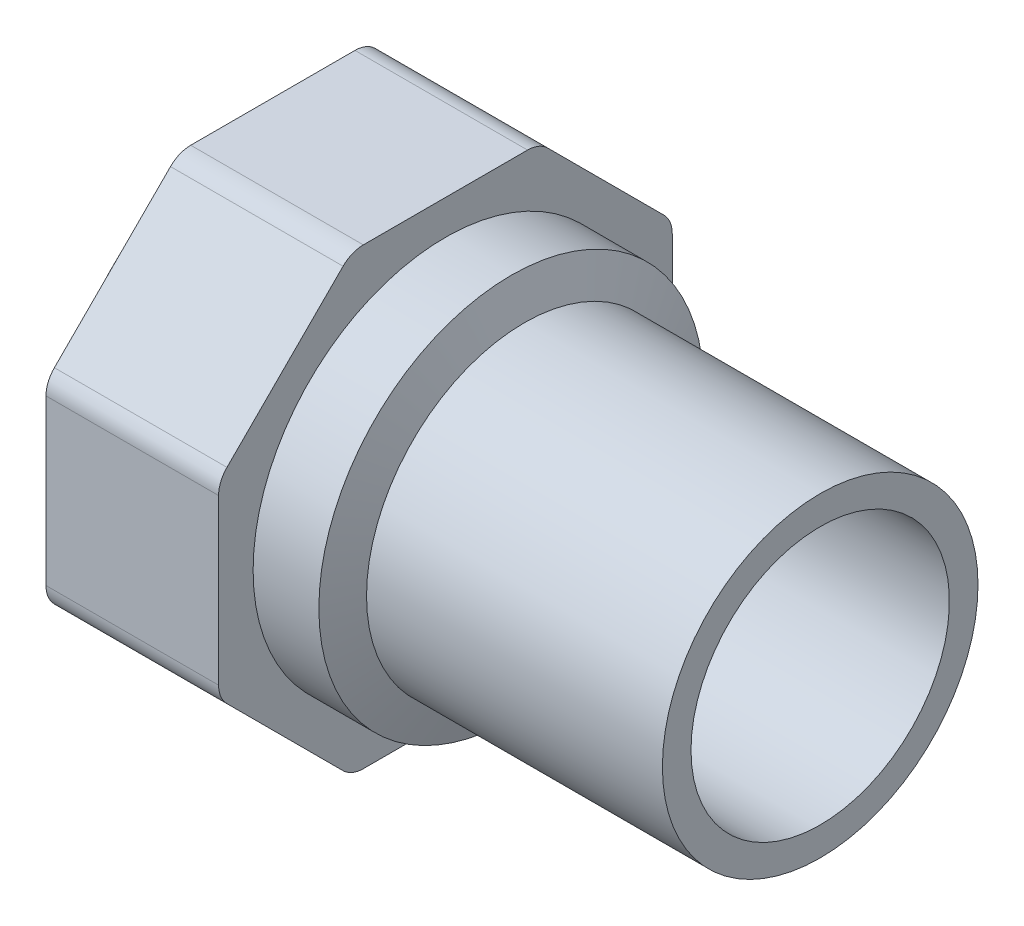
ISO-10303-21;
HEADER;
FILE_DESCRIPTION(('STEP AP214'),'2;1');
FILE_NAME('part.step','',(''),(''),'','','');
FILE_SCHEMA(('AUTOMOTIVE_DESIGN { 1 0 10303 214 1 1 1 1 }'));
ENDSEC;
DATA;
#1=APPLICATION_CONTEXT('core data for automotive mechanical design processes');
#2=APPLICATION_PROTOCOL_DEFINITION('international standard','automotive_design',2000,#1);
#3=PRODUCT_CONTEXT('',#1,'mechanical');
#4=PRODUCT('Part','Part','',(#3));
#5=PRODUCT_RELATED_PRODUCT_CATEGORY('part','',(#4));
#6=PRODUCT_DEFINITION_FORMATION('','',#4);
#7=PRODUCT_DEFINITION_CONTEXT('part definition',#1,'design');
#8=PRODUCT_DEFINITION('design','',#6,#7);
#9=PRODUCT_DEFINITION_SHAPE('','',#8);
#10=(LENGTH_UNIT() NAMED_UNIT(*) SI_UNIT(.MILLI.,.METRE.));
#11=(NAMED_UNIT(*) PLANE_ANGLE_UNIT() SI_UNIT($,.RADIAN.));
#12=(NAMED_UNIT(*) SI_UNIT($,.STERADIAN.) SOLID_ANGLE_UNIT());
#13=UNCERTAINTY_MEASURE_WITH_UNIT(LENGTH_MEASURE(1.E-05),#10,'distance_accuracy_value','');
#14=(GEOMETRIC_REPRESENTATION_CONTEXT(3) GLOBAL_UNCERTAINTY_ASSIGNED_CONTEXT((#13)) GLOBAL_UNIT_ASSIGNED_CONTEXT((#10,
#11,#12)) REPRESENTATION_CONTEXT('',''));
#15=CARTESIAN_POINT('',(0.,0.,0.));
#16=DIRECTION('',(0.,0.,1.));
#17=DIRECTION('',(1.,0.,0.));
#18=AXIS2_PLACEMENT_3D('',#15,#16,#17);
#19=CARTESIAN_POINT('',(-30.,0.,0.));
#20=DIRECTION('',(-1.,0.,0.));
#21=DIRECTION('',(0.,0.,1.));
#22=AXIS2_PLACEMENT_3D('',#19,#20,#21);
#23=CYLINDRICAL_SURFACE('',#22,16.);
#24=CARTESIAN_POINT('',(-30.,0.,0.));
#25=DIRECTION('',(1.,0.,0.));
#26=DIRECTION('',(0.,1.,0.));
#27=AXIS2_PLACEMENT_3D('',#24,#25,#26);
#28=CIRCLE('',#27,16.);
#29=CARTESIAN_POINT('',(-30.,16.,0.));
#30=VERTEX_POINT('',#29);
#31=EDGE_CURVE('E193',#30,#30,#28,.F.);
#32=ORIENTED_EDGE('',*,*,#31,.F.);
#33=EDGE_LOOP('',(#32));
#34=FACE_BOUND('',#33,.T.);
#35=CARTESIAN_POINT('',(0.,0.,0.));
#36=DIRECTION('',(-1.,0.,0.));
#37=DIRECTION('',(0.,0.,1.));
#38=AXIS2_PLACEMENT_3D('',#35,#36,#37);
#39=CIRCLE('',#38,16.);
#40=CARTESIAN_POINT('',(0.,0.,16.));
#41=VERTEX_POINT('',#40);
#42=EDGE_CURVE('E18',#41,#41,#39,.F.);
#43=ORIENTED_EDGE('',*,*,#42,.F.);
#44=EDGE_LOOP('',(#43));
#45=FACE_BOUND('',#44,.T.);
#46=ADVANCED_FACE('F15',(#34,#45),#23,.T.);
#47=CARTESIAN_POINT('',(-30.,0.,0.));
#48=DIRECTION('',(-1.,0.,0.));
#49=DIRECTION('',(0.,0.,1.));
#50=AXIS2_PLACEMENT_3D('',#47,#48,#49);
#51=CONICAL_SURFACE('',#50,16.,1.20681737028525);
#52=CARTESIAN_POINT('',(-31.3333333333333,0.,0.));
#53=DIRECTION('',(-1.,0.,0.));
#54=DIRECTION('',(0.,1.,0.));
#55=AXIS2_PLACEMENT_3D('',#52,#53,#54);
#56=CIRCLE('',#55,19.5);
#57=CARTESIAN_POINT('',(-31.3333333333333,19.5,0.));
#58=VERTEX_POINT('',#57);
#59=EDGE_CURVE('E189',#58,#58,#56,.T.);
#60=ORIENTED_EDGE('',*,*,#59,.F.);
#61=EDGE_LOOP('',(#60));
#62=FACE_BOUND('',#61,.T.);
#63=ORIENTED_EDGE('',*,*,#31,.T.);
#64=EDGE_LOOP('',(#63));
#65=FACE_BOUND('',#64,.T.);
#66=ADVANCED_FACE('F268',(#62,#65),#51,.T.);
#67=CARTESIAN_POINT('',(0.,16.,16.1920021082986));
#68=DIRECTION('',(1.,0.,0.));
#69=DIRECTION('',(0.,-1.,0.));
#70=AXIS2_PLACEMENT_3D('',#67,#68,#69);
#71=PLANE('',#70);
#72=CARTESIAN_POINT('',(0.,0.,0.));
#73=DIRECTION('',(-1.,0.,0.));
#74=DIRECTION('',(0.,0.,1.));
#75=AXIS2_PLACEMENT_3D('',#72,#73,#74);
#76=CIRCLE('',#75,13.1);
#77=CARTESIAN_POINT('',(0.,0.,13.1));
#78=VERTEX_POINT('',#77);
#79=EDGE_CURVE('E192',#78,#78,#76,.F.);
#80=ORIENTED_EDGE('',*,*,#79,.F.);
#81=EDGE_LOOP('',(#80));
#82=FACE_BOUND('',#81,.T.);
#83=ORIENTED_EDGE('',*,*,#42,.T.);
#84=EDGE_LOOP('',(#83));
#85=FACE_BOUND('',#84,.T.);
#86=ADVANCED_FACE('F264',(#82,#85),#71,.T.);
#87=CARTESIAN_POINT('',(-38.,0.,0.));
#88=DIRECTION('',(-1.,0.,0.));
#89=DIRECTION('',(0.,0.,1.));
#90=AXIS2_PLACEMENT_3D('',#87,#88,#89);
#91=CYLINDRICAL_SURFACE('',#90,19.5);
#92=CARTESIAN_POINT('',(-38.,0.,0.));
#93=DIRECTION('',(-1.,0.,0.));
#94=DIRECTION('',(0.,0.,1.));
#95=AXIS2_PLACEMENT_3D('',#92,#93,#94);
#96=CIRCLE('',#95,19.5);
#97=CARTESIAN_POINT('',(-38.,0.,19.5));
#98=VERTEX_POINT('',#97);
#99=EDGE_CURVE('E188',#98,#98,#96,.T.);
#100=ORIENTED_EDGE('',*,*,#99,.F.);
#101=EDGE_LOOP('',(#100));
#102=FACE_BOUND('',#101,.T.);
#103=ORIENTED_EDGE('',*,*,#59,.T.);
#104=EDGE_LOOP('',(#103));
#105=FACE_BOUND('',#104,.T.);
#106=ADVANCED_FACE('F267',(#102,#105),#91,.T.);
#107=CARTESIAN_POINT('',(0.,0.,0.));
#108=DIRECTION('',(-1.,0.,0.));
#109=DIRECTION('',(0.,0.,1.));
#110=AXIS2_PLACEMENT_3D('',#107,#108,#109);
#111=CYLINDRICAL_SURFACE('',#110,13.1);
#112=ORIENTED_EDGE('',*,*,#79,.T.);
#113=EDGE_LOOP('',(#112));
#114=FACE_BOUND('',#113,.T.);
#115=CARTESIAN_POINT('',(-37.4889077302988,0.,0.));
#116=DIRECTION('',(1.,0.,0.));
#117=DIRECTION('',(0.,1.,0.));
#118=AXIS2_PLACEMENT_3D('',#115,#116,#117);
#119=CIRCLE('',#118,13.1);
#120=CARTESIAN_POINT('',(-37.4889077302988,13.1,0.));
#121=VERTEX_POINT('',#120);
#122=EDGE_CURVE('E135',#121,#121,#119,.T.);
#123=ORIENTED_EDGE('',*,*,#122,.F.);
#124=EDGE_LOOP('',(#123));
#125=FACE_BOUND('',#124,.T.);
#126=ADVANCED_FACE('F261',(#114,#125),#111,.F.);
#127=CARTESIAN_POINT('',(-38.,23.,23.));
#128=DIRECTION('',(1.,0.,0.));
#129=DIRECTION('',(0.,-1.,0.));
#130=AXIS2_PLACEMENT_3D('',#127,#128,#129);
#131=PLANE('',#130);
#132=ORIENTED_EDGE('',*,*,#99,.T.);
#133=EDGE_LOOP('',(#132));
#134=FACE_BOUND('',#133,.T.);
#135=CARTESIAN_POINT('',(-38.,8.32569260369921,20.1));
#136=DIRECTION('',(1.,0.,0.));
#137=DIRECTION('',(0.,0.,-1.));
#138=AXIS2_PLACEMENT_3D('',#135,#136,#137);
#139=CIRCLE('',#138,2.89999999999997);
#140=CARTESIAN_POINT('',(-38.,8.32569260369921,23.));
#141=VERTEX_POINT('',#140);
#142=CARTESIAN_POINT('',(-38.,10.3763022691402,22.150609665441));
#143=VERTEX_POINT('',#142);
#144=EDGE_CURVE('E254',#141,#143,#139,.F.);
#145=ORIENTED_EDGE('',*,*,#144,.F.);
#146=DIRECTION('',(0.,1.,0.));
#147=VECTOR('',#146,1.);
#148=CARTESIAN_POINT('',(-38.,0.,23.));
#149=LINE('',#148,#147);
#150=CARTESIAN_POINT('',(-38.,-8.32569260369924,23.));
#151=VERTEX_POINT('',#150);
#152=EDGE_CURVE('E132',#151,#141,#149,.T.);
#153=ORIENTED_EDGE('',*,*,#152,.F.);
#154=CARTESIAN_POINT('',(-38.,-8.32569260369924,20.1));
#155=DIRECTION('',(1.,0.,0.));
#156=DIRECTION('',(0.,0.,-1.));
#157=AXIS2_PLACEMENT_3D('',#154,#155,#156);
#158=CIRCLE('',#157,2.89999999999999);
#159=CARTESIAN_POINT('',(-38.,-10.3763022691402,22.150609665441));
#160=VERTEX_POINT('',#159);
#161=EDGE_CURVE('E126',#160,#151,#158,.F.);
#162=ORIENTED_EDGE('',*,*,#161,.F.);
#163=DIRECTION('',(0.,0.707106781186547,0.707106781186548));
#164=VECTOR('',#163,1.);
#165=CARTESIAN_POINT('',(-38.,-16.2634559672906,16.2634559672906));
#166=LINE('',#165,#164);
#167=CARTESIAN_POINT('',(-38.,-22.150609665441,10.3763022691402));
#168=VERTEX_POINT('',#167);
#169=EDGE_CURVE('E130',#168,#160,#166,.T.);
#170=ORIENTED_EDGE('',*,*,#169,.F.);
#171=CARTESIAN_POINT('',(-38.,-20.1,8.32569260369922));
#172=DIRECTION('',(1.,0.,0.));
#173=DIRECTION('',(0.,0.,-1.));
#174=AXIS2_PLACEMENT_3D('',#171,#172,#173);
#175=CIRCLE('',#174,2.89999999999997);
#176=CARTESIAN_POINT('',(-38.,-23.,8.32569260369922));
#177=VERTEX_POINT('',#176);
#178=EDGE_CURVE('E149',#177,#168,#175,.F.);
#179=ORIENTED_EDGE('',*,*,#178,.F.);
#180=DIRECTION('',(0.,0.,1.));
#181=VECTOR('',#180,1.);
#182=CARTESIAN_POINT('',(-38.,-23.,0.));
#183=LINE('',#182,#181);
#184=CARTESIAN_POINT('',(-38.,-23.,-8.32569260369922));
#185=VERTEX_POINT('',#184);
#186=EDGE_CURVE('E154',#185,#177,#183,.T.);
#187=ORIENTED_EDGE('',*,*,#186,.F.);
#188=CARTESIAN_POINT('',(-38.,-20.1,-8.32569260369922));
#189=DIRECTION('',(1.,0.,0.));
#190=DIRECTION('',(0.,0.,-1.));
#191=AXIS2_PLACEMENT_3D('',#188,#189,#190);
#192=CIRCLE('',#191,2.89999999999999);
#193=CARTESIAN_POINT('',(-38.,-22.150609665441,-10.3763022691402));
#194=VERTEX_POINT('',#193);
#195=EDGE_CURVE('E239',#194,#185,#192,.F.);
#196=ORIENTED_EDGE('',*,*,#195,.F.);
#197=DIRECTION('',(0.,-0.707106781186548,0.707106781186547));
#198=VECTOR('',#197,1.);
#199=CARTESIAN_POINT('',(-38.,-16.2634559672906,-16.2634559672906));
#200=LINE('',#199,#198);
#201=CARTESIAN_POINT('',(-38.,-10.3763022691402,-22.150609665441));
#202=VERTEX_POINT('',#201);
#203=EDGE_CURVE('E159',#202,#194,#200,.T.);
#204=ORIENTED_EDGE('',*,*,#203,.F.);
#205=CARTESIAN_POINT('',(-38.,-8.32569260369921,-20.1));
#206=DIRECTION('',(1.,0.,0.));
#207=DIRECTION('',(0.,0.,-1.));
#208=AXIS2_PLACEMENT_3D('',#205,#206,#207);
#209=CIRCLE('',#208,2.89999999999998);
#210=CARTESIAN_POINT('',(-38.,-8.32569260369921,-23.));
#211=VERTEX_POINT('',#210);
#212=EDGE_CURVE('E242',#211,#202,#209,.F.);
#213=ORIENTED_EDGE('',*,*,#212,.F.);
#214=DIRECTION('',(0.,-1.,0.));
#215=VECTOR('',#214,1.);
#216=CARTESIAN_POINT('',(-38.,0.,-23.));
#217=LINE('',#216,#215);
#218=CARTESIAN_POINT('',(-38.,8.32569260369922,-23.));
#219=VERTEX_POINT('',#218);
#220=EDGE_CURVE('E164',#219,#211,#217,.T.);
#221=ORIENTED_EDGE('',*,*,#220,.F.);
#222=CARTESIAN_POINT('',(-38.,8.32569260369922,-20.1));
#223=DIRECTION('',(1.,0.,0.));
#224=DIRECTION('',(0.,0.,-1.));
#225=AXIS2_PLACEMENT_3D('',#222,#223,#224);
#226=CIRCLE('',#225,2.89999999999999);
#227=CARTESIAN_POINT('',(-38.,10.3763022691402,-22.150609665441));
#228=VERTEX_POINT('',#227);
#229=EDGE_CURVE('E245',#228,#219,#226,.F.);
#230=ORIENTED_EDGE('',*,*,#229,.F.);
#231=DIRECTION('',(0.,-0.707106781186547,-0.707106781186547));
#232=VECTOR('',#231,1.);
#233=CARTESIAN_POINT('',(-38.,16.2634559672906,-16.2634559672906));
#234=LINE('',#233,#232);
#235=CARTESIAN_POINT('',(-38.,22.150609665441,-10.3763022691402));
#236=VERTEX_POINT('',#235);
#237=EDGE_CURVE('E169',#236,#228,#234,.T.);
#238=ORIENTED_EDGE('',*,*,#237,.F.);
#239=CARTESIAN_POINT('',(-38.,20.1,-8.32569260369922));
#240=DIRECTION('',(1.,0.,0.));
#241=DIRECTION('',(0.,0.,-1.));
#242=AXIS2_PLACEMENT_3D('',#239,#240,#241);
#243=CIRCLE('',#242,2.89999999999998);
#244=CARTESIAN_POINT('',(-38.,23.,-8.32569260369922));
#245=VERTEX_POINT('',#244);
#246=EDGE_CURVE('E248',#245,#236,#243,.F.);
#247=ORIENTED_EDGE('',*,*,#246,.F.);
#248=DIRECTION('',(0.,0.,-1.));
#249=VECTOR('',#248,1.);
#250=CARTESIAN_POINT('',(-38.,23.,0.));
#251=LINE('',#250,#249);
#252=CARTESIAN_POINT('',(-38.,23.,8.32569260369922));
#253=VERTEX_POINT('',#252);
#254=EDGE_CURVE('E174',#253,#245,#251,.T.);
#255=ORIENTED_EDGE('',*,*,#254,.F.);
#256=CARTESIAN_POINT('',(-38.,20.1000000000001,8.32569260369922));
#257=DIRECTION('',(1.,0.,0.));
#258=DIRECTION('',(0.,0.,-1.));
#259=AXIS2_PLACEMENT_3D('',#256,#257,#258);
#260=CIRCLE('',#259,2.89999999999995);
#261=CARTESIAN_POINT('',(-38.,22.150609665441,10.3763022691402));
#262=VERTEX_POINT('',#261);
#263=EDGE_CURVE('E251',#262,#253,#260,.F.);
#264=ORIENTED_EDGE('',*,*,#263,.F.);
#265=DIRECTION('',(0.,0.707106781186548,-0.707106781186547));
#266=VECTOR('',#265,1.);
#267=CARTESIAN_POINT('',(-38.,16.2634559672906,16.2634559672906));
#268=LINE('',#267,#266);
#269=EDGE_CURVE('E179',#143,#262,#268,.T.);
#270=ORIENTED_EDGE('',*,*,#269,.F.);
#271=EDGE_LOOP('',(#145,#153,#162,#170,#179,#187,#196,#204,#213,#221,#230,#238,#247,#255,#264,#270));
#272=FACE_BOUND('',#271,.T.);
#273=ADVANCED_FACE('F128',(#134,#272),#131,.T.);
#274=CARTESIAN_POINT('',(-38.,0.,0.));
#275=DIRECTION('',(-1.,0.,0.));
#276=DIRECTION('',(0.,0.,1.));
#277=AXIS2_PLACEMENT_3D('',#274,#275,#276);
#278=CONICAL_SURFACE('',#277,13.9852377784781,1.0471975511966);
#279=ORIENTED_EDGE('',*,*,#122,.T.);
#280=EDGE_LOOP('',(#279));
#281=FACE_BOUND('',#280,.T.);
#282=CARTESIAN_POINT('',(-38.,0.,0.));
#283=DIRECTION('',(1.,0.,0.));
#284=DIRECTION('',(0.,1.,0.));
#285=AXIS2_PLACEMENT_3D('',#282,#283,#284);
#286=CIRCLE('',#285,13.9852377784781);
#287=CARTESIAN_POINT('',(-38.,13.9852377784781,0.));
#288=VERTEX_POINT('',#287);
#289=EDGE_CURVE('E153',#288,#288,#286,.T.);
#290=ORIENTED_EDGE('',*,*,#289,.F.);
#291=EDGE_LOOP('',(#290));
#292=FACE_BOUND('',#291,.T.);
#293=ADVANCED_FACE('F438',(#281,#292),#278,.F.);
#294=CARTESIAN_POINT('',(-38.,-8.32569260369924,20.1));
#295=DIRECTION('',(1.,0.,0.));
#296=DIRECTION('',(0.,0.,-1.));
#297=AXIS2_PLACEMENT_3D('',#294,#295,#296);
#298=CYLINDRICAL_SURFACE('',#297,2.89999999999999);
#299=CARTESIAN_POINT('',(-55.5,-8.32569260369924,20.1));
#300=DIRECTION('',(1.,0.,0.));
#301=DIRECTION('',(0.,0.,-1.));
#302=AXIS2_PLACEMENT_3D('',#299,#300,#301);
#303=CIRCLE('',#302,2.89999999999999);
#304=CARTESIAN_POINT('',(-55.5,-10.3763022691402,22.150609665441));
#305=VERTEX_POINT('',#304);
#306=CARTESIAN_POINT('',(-55.5,-8.32569260369924,23.));
#307=VERTEX_POINT('',#306);
#308=EDGE_CURVE('E141',#305,#307,#303,.F.);
#309=ORIENTED_EDGE('',*,*,#308,.F.);
#310=DIRECTION('',(1.,0.,0.));
#311=VECTOR('',#310,1.);
#312=CARTESIAN_POINT('',(-55.5,-10.3763022691402,22.150609665441));
#313=LINE('',#312,#311);
#314=EDGE_CURVE('E138',#160,#305,#313,.F.);
#315=ORIENTED_EDGE('',*,*,#314,.F.);
#316=ORIENTED_EDGE('',*,*,#161,.T.);
#317=DIRECTION('',(1.,0.,0.));
#318=VECTOR('',#317,1.);
#319=CARTESIAN_POINT('',(-55.5,-8.32569260369924,23.));
#320=LINE('',#319,#318);
#321=EDGE_CURVE('E185',#307,#151,#320,.T.);
#322=ORIENTED_EDGE('',*,*,#321,.F.);
#323=EDGE_LOOP('',(#309,#315,#316,#322));
#324=FACE_BOUND('',#323,.T.);
#325=ADVANCED_FACE('F139',(#324),#298,.T.);
#326=CARTESIAN_POINT('',(-55.5,8.3256926036992,23.));
#327=DIRECTION('',(0.,0.,1.));
#328=DIRECTION('',(0.,-1.,0.));
#329=AXIS2_PLACEMENT_3D('',#326,#327,#328);
#330=PLANE('',#329);
#331=DIRECTION('',(0.,1.,0.));
#332=VECTOR('',#331,1.);
#333=CARTESIAN_POINT('',(-55.5,0.,23.));
#334=LINE('',#333,#332);
#335=CARTESIAN_POINT('',(-55.5,8.32569260369921,23.));
#336=VERTEX_POINT('',#335);
#337=EDGE_CURVE('E236',#307,#336,#334,.T.);
#338=ORIENTED_EDGE('',*,*,#337,.F.);
#339=ORIENTED_EDGE('',*,*,#321,.T.);
#340=ORIENTED_EDGE('',*,*,#152,.T.);
#341=DIRECTION('',(1.,0.,0.));
#342=VECTOR('',#341,1.);
#343=CARTESIAN_POINT('',(-46.75,8.3256926036992,23.));
#344=LINE('',#343,#342);
#345=EDGE_CURVE('E183',#336,#141,#344,.T.);
#346=ORIENTED_EDGE('',*,*,#345,.F.);
#347=EDGE_LOOP('',(#338,#339,#340,#346));
#348=FACE_BOUND('',#347,.T.);
#349=ADVANCED_FACE('F387',(#348),#330,.T.);
#350=CARTESIAN_POINT('',(-38.,8.32569260369921,20.1));
#351=DIRECTION('',(1.,0.,0.));
#352=DIRECTION('',(0.,0.,-1.));
#353=AXIS2_PLACEMENT_3D('',#350,#351,#352);
#354=CYLINDRICAL_SURFACE('',#353,2.89999999999997);
#355=CARTESIAN_POINT('',(-55.5,8.32569260369921,20.1));
#356=DIRECTION('',(1.,0.,0.));
#357=DIRECTION('',(0.,0.,-1.));
#358=AXIS2_PLACEMENT_3D('',#355,#356,#357);
#359=CIRCLE('',#358,2.89999999999997);
#360=CARTESIAN_POINT('',(-55.5,10.3763022691402,22.150609665441));
#361=VERTEX_POINT('',#360);
#362=EDGE_CURVE('E233',#336,#361,#359,.F.);
#363=ORIENTED_EDGE('',*,*,#362,.F.);
#364=ORIENTED_EDGE('',*,*,#345,.T.);
#365=ORIENTED_EDGE('',*,*,#144,.T.);
#366=DIRECTION('',(1.,0.,0.));
#367=VECTOR('',#366,1.);
#368=CARTESIAN_POINT('',(-55.5,10.3763022691402,22.150609665441));
#369=LINE('',#368,#367);
#370=EDGE_CURVE('E182',#361,#143,#369,.T.);
#371=ORIENTED_EDGE('',*,*,#370,.F.);
#372=EDGE_LOOP('',(#363,#364,#365,#371));
#373=FACE_BOUND('',#372,.T.);
#374=ADVANCED_FACE('F425',(#373),#354,.T.);
#375=CARTESIAN_POINT('',(-55.5,22.150609665441,10.3763022691402));
#376=DIRECTION('',(0.,0.707106781186547,0.707106781186548));
#377=DIRECTION('',(0.,-0.707106781186548,0.707106781186547));
#378=AXIS2_PLACEMENT_3D('',#375,#376,#377);
#379=PLANE('',#378);
#380=CARTESIAN_POINT('',(-55.5,10.3763022691402,22.150609665441));
#381=CARTESIAN_POINT('',(-55.5,10.8668984106527,21.6600135239285));
#382=CARTESIAN_POINT('',(-55.5,11.3574945521653,21.1694173824159));
#383=CARTESIAN_POINT('',(-55.5,12.3386868351903,20.1882250993909));
#384=CARTESIAN_POINT('',(-55.5,12.8292829767029,19.6976289578783));
#385=CARTESIAN_POINT('',(-55.5,13.8104752597279,18.7164366748533));
#386=CARTESIAN_POINT('',(-55.5,14.3010714012405,18.2258405333407));
#387=CARTESIAN_POINT('',(-55.5,15.2822636842655,17.2446482503157));
#388=CARTESIAN_POINT('',(-55.5,15.7728598257781,16.7540521088031));
#389=CARTESIAN_POINT('',(-55.5,16.7540521088031,15.7728598257781));
#390=CARTESIAN_POINT('',(-55.5,17.2446482503156,15.2822636842655));
#391=CARTESIAN_POINT('',(-55.5,18.2258405333407,14.3010714012405));
#392=CARTESIAN_POINT('',(-55.5,18.7164366748532,13.8104752597279));
#393=CARTESIAN_POINT('',(-55.5,19.6976289578783,12.8292829767029));
#394=CARTESIAN_POINT('',(-55.5,20.1882250993908,12.3386868351903));
#395=CARTESIAN_POINT('',(-55.5,21.1694173824159,11.3574945521653));
#396=CARTESIAN_POINT('',(-55.5,21.6600135239284,10.8668984106527));
#397=CARTESIAN_POINT('',(-55.5,22.150609665441,10.3763022691402));
#398=B_SPLINE_CURVE_WITH_KNOTS('',3,(#380,#381,#382,#383,#384,#385,#386,#387,#388,#389,#390,
#391,#392,#393,#394,#395,#396,#397),.UNSPECIFIED.,.F.,.F.,(4,2,2,2,2,2,2,2,4),(0.,
2.08142315092481,4.16284630184961,6.24426945277441,8.32569260369921,10.407115754624,
12.4885389055488,14.5699620564736,16.6513852073984),.UNSPECIFIED.);
#399=CARTESIAN_POINT('',(-55.5,22.150609665441,10.3763022691402));
#400=VERTEX_POINT('',#399);
#401=EDGE_CURVE('E232',#361,#400,#398,.T.);
#402=ORIENTED_EDGE('',*,*,#401,.F.);
#403=ORIENTED_EDGE('',*,*,#370,.T.);
#404=ORIENTED_EDGE('',*,*,#269,.T.);
#405=DIRECTION('',(1.,0.,0.));
#406=VECTOR('',#405,1.);
#407=CARTESIAN_POINT('',(-46.75,22.150609665441,10.3763022691402));
#408=LINE('',#407,#406);
#409=EDGE_CURVE('E178',#400,#262,#408,.T.);
#410=ORIENTED_EDGE('',*,*,#409,.F.);
#411=EDGE_LOOP('',(#402,#403,#404,#410));
#412=FACE_BOUND('',#411,.T.);
#413=ADVANCED_FACE('F423',(#412),#379,.T.);
#414=CARTESIAN_POINT('',(-38.,20.1000000000001,8.32569260369922));
#415=DIRECTION('',(1.,0.,0.));
#416=DIRECTION('',(0.,0.,-1.));
#417=AXIS2_PLACEMENT_3D('',#414,#415,#416);
#418=CYLINDRICAL_SURFACE('',#417,2.89999999999995);
#419=CARTESIAN_POINT('',(-55.5,20.1000000000001,8.32569260369922));
#420=DIRECTION('',(1.,0.,0.));
#421=DIRECTION('',(0.,0.,-1.));
#422=AXIS2_PLACEMENT_3D('',#419,#420,#421);
#423=CIRCLE('',#422,2.89999999999995);
#424=CARTESIAN_POINT('',(-55.5,23.,8.32569260369922));
#425=VERTEX_POINT('',#424);
#426=EDGE_CURVE('E229',#400,#425,#423,.F.);
#427=ORIENTED_EDGE('',*,*,#426,.F.);
#428=ORIENTED_EDGE('',*,*,#409,.T.);
#429=ORIENTED_EDGE('',*,*,#263,.T.);
#430=DIRECTION('',(1.,0.,0.));
#431=VECTOR('',#430,1.);
#432=CARTESIAN_POINT('',(-55.5,23.,8.32569260369921));
#433=LINE('',#432,#431);
#434=EDGE_CURVE('E177',#425,#253,#433,.T.);
#435=ORIENTED_EDGE('',*,*,#434,.F.);
#436=EDGE_LOOP('',(#427,#428,#429,#435));
#437=FACE_BOUND('',#436,.T.);
#438=ADVANCED_FACE('F420',(#437),#418,.T.);
#439=CARTESIAN_POINT('',(-55.5,23.,-8.32569260369921));
#440=DIRECTION('',(0.,1.,0.));
#441=DIRECTION('',(0.,0.,1.));
#442=AXIS2_PLACEMENT_3D('',#439,#440,#441);
#443=PLANE('',#442);
#444=DIRECTION('',(0.,0.,-1.));
#445=VECTOR('',#444,1.);
#446=CARTESIAN_POINT('',(-55.5,23.,23.));
#447=LINE('',#446,#445);
#448=CARTESIAN_POINT('',(-55.5,23.,-8.32569260369922));
#449=VERTEX_POINT('',#448);
#450=EDGE_CURVE('E228',#425,#449,#447,.T.);
#451=ORIENTED_EDGE('',*,*,#450,.F.);
#452=ORIENTED_EDGE('',*,*,#434,.T.);
#453=ORIENTED_EDGE('',*,*,#254,.T.);
#454=DIRECTION('',(1.,0.,0.));
#455=VECTOR('',#454,1.);
#456=CARTESIAN_POINT('',(-46.75,23.,-8.32569260369922));
#457=LINE('',#456,#455);
#458=EDGE_CURVE('E173',#449,#245,#457,.T.);
#459=ORIENTED_EDGE('',*,*,#458,.F.);
#460=EDGE_LOOP('',(#451,#452,#453,#459));
#461=FACE_BOUND('',#460,.T.);
#462=ADVANCED_FACE('F417',(#461),#443,.T.);
#463=CARTESIAN_POINT('',(-38.,20.1,-8.32569260369922));
#464=DIRECTION('',(1.,0.,0.));
#465=DIRECTION('',(0.,0.,-1.));
#466=AXIS2_PLACEMENT_3D('',#463,#464,#465);
#467=CYLINDRICAL_SURFACE('',#466,2.89999999999998);
#468=CARTESIAN_POINT('',(-55.5,20.1,-8.32569260369922));
#469=DIRECTION('',(1.,0.,0.));
#470=DIRECTION('',(0.,0.,-1.));
#471=AXIS2_PLACEMENT_3D('',#468,#469,#470);
#472=CIRCLE('',#471,2.89999999999998);
#473=CARTESIAN_POINT('',(-55.5,22.150609665441,-10.3763022691402));
#474=VERTEX_POINT('',#473);
#475=EDGE_CURVE('E225',#449,#474,#472,.F.);
#476=ORIENTED_EDGE('',*,*,#475,.F.);
#477=ORIENTED_EDGE('',*,*,#458,.T.);
#478=ORIENTED_EDGE('',*,*,#246,.T.);
#479=DIRECTION('',(1.,0.,0.));
#480=VECTOR('',#479,1.);
#481=CARTESIAN_POINT('',(-55.5,22.150609665441,-10.3763022691402));
#482=LINE('',#481,#480);
#483=EDGE_CURVE('E172',#474,#236,#482,.T.);
#484=ORIENTED_EDGE('',*,*,#483,.F.);
#485=EDGE_LOOP('',(#476,#477,#478,#484));
#486=FACE_BOUND('',#485,.T.);
#487=ADVANCED_FACE('F414',(#486),#467,.T.);
#488=CARTESIAN_POINT('',(-55.5,10.3763022691402,-22.150609665441));
#489=DIRECTION('',(0.,0.707106781186547,-0.707106781186547));
#490=DIRECTION('',(0.,0.707106781186547,0.707106781186547));
#491=AXIS2_PLACEMENT_3D('',#488,#489,#490);
#492=PLANE('',#491);
#493=CARTESIAN_POINT('',(-55.5,22.150609665441,-10.3763022691402));
#494=CARTESIAN_POINT('',(-55.5,21.6600135239285,-10.8668984106527));
#495=CARTESIAN_POINT('',(-55.5,21.1694173824159,-11.3574945521653));
#496=CARTESIAN_POINT('',(-55.5,20.1882250993909,-12.3386868351903));
#497=CARTESIAN_POINT('',(-55.5,19.6976289578783,-12.8292829767029));
#498=CARTESIAN_POINT('',(-55.5,18.7164366748533,-13.8104752597279));
#499=CARTESIAN_POINT('',(-55.5,18.2258405333407,-14.3010714012405));
#500=CARTESIAN_POINT('',(-55.5,17.2446482503157,-15.2822636842655));
#501=CARTESIAN_POINT('',(-55.5,16.7540521088031,-15.7728598257781));
#502=CARTESIAN_POINT('',(-55.5,15.7728598257781,-16.7540521088031));
#503=CARTESIAN_POINT('',(-55.5,15.2822636842655,-17.2446482503157));
#504=CARTESIAN_POINT('',(-55.5,14.3010714012405,-18.2258405333407));
#505=CARTESIAN_POINT('',(-55.5,13.8104752597279,-18.7164366748533));
#506=CARTESIAN_POINT('',(-55.5,12.8292829767029,-19.6976289578783));
#507=CARTESIAN_POINT('',(-55.5,12.3386868351903,-20.1882250993909));
#508=CARTESIAN_POINT('',(-55.5,11.3574945521653,-21.1694173824159));
#509=CARTESIAN_POINT('',(-55.5,10.8668984106527,-21.6600135239284));
#510=CARTESIAN_POINT('',(-55.5,10.3763022691402,-22.150609665441));
#511=B_SPLINE_CURVE_WITH_KNOTS('',3,(#493,#494,#495,#496,#497,#498,#499,#500,#501,#502,#503,
#504,#505,#506,#507,#508,#509,#510),.UNSPECIFIED.,.F.,.F.,(4,2,2,2,2,2,2,2,4),(0.,
2.0814231509248,4.1628463018496,6.2442694527744,8.3256926036992,10.407115754624,
12.4885389055488,14.5699620564736,16.6513852073984),.UNSPECIFIED.);
#512=CARTESIAN_POINT('',(-55.5,10.3763022691402,-22.150609665441));
#513=VERTEX_POINT('',#512);
#514=EDGE_CURVE('E224',#474,#513,#511,.T.);
#515=ORIENTED_EDGE('',*,*,#514,.F.);
#516=ORIENTED_EDGE('',*,*,#483,.T.);
#517=ORIENTED_EDGE('',*,*,#237,.T.);
#518=DIRECTION('',(1.,0.,0.));
#519=VECTOR('',#518,1.);
#520=CARTESIAN_POINT('',(-46.75,10.3763022691402,-22.150609665441));
#521=LINE('',#520,#519);
#522=EDGE_CURVE('E168',#513,#228,#521,.T.);
#523=ORIENTED_EDGE('',*,*,#522,.F.);
#524=EDGE_LOOP('',(#515,#516,#517,#523));
#525=FACE_BOUND('',#524,.T.);
#526=ADVANCED_FACE('F411',(#525),#492,.T.);
#527=CARTESIAN_POINT('',(-38.,8.32569260369922,-20.1));
#528=DIRECTION('',(1.,0.,0.));
#529=DIRECTION('',(0.,0.,-1.));
#530=AXIS2_PLACEMENT_3D('',#527,#528,#529);
#531=CYLINDRICAL_SURFACE('',#530,2.89999999999999);
#532=CARTESIAN_POINT('',(-55.5,8.32569260369922,-20.1));
#533=DIRECTION('',(1.,0.,0.));
#534=DIRECTION('',(0.,0.,-1.));
#535=AXIS2_PLACEMENT_3D('',#532,#533,#534);
#536=CIRCLE('',#535,2.89999999999999);
#537=CARTESIAN_POINT('',(-55.5,8.32569260369922,-23.));
#538=VERTEX_POINT('',#537);
#539=EDGE_CURVE('E221',#513,#538,#536,.F.);
#540=ORIENTED_EDGE('',*,*,#539,.F.);
#541=ORIENTED_EDGE('',*,*,#522,.T.);
#542=ORIENTED_EDGE('',*,*,#229,.T.);
#543=DIRECTION('',(1.,0.,0.));
#544=VECTOR('',#543,1.);
#545=CARTESIAN_POINT('',(-55.5,8.32569260369922,-23.));
#546=LINE('',#545,#544);
#547=EDGE_CURVE('E167',#538,#219,#546,.T.);
#548=ORIENTED_EDGE('',*,*,#547,.F.);
#549=EDGE_LOOP('',(#540,#541,#542,#548));
#550=FACE_BOUND('',#549,.T.);
#551=ADVANCED_FACE('F408',(#550),#531,.T.);
#552=CARTESIAN_POINT('',(-55.5,-8.3256926036992,-23.));
#553=DIRECTION('',(0.,0.,-1.));
#554=DIRECTION('',(0.,1.,0.));
#555=AXIS2_PLACEMENT_3D('',#552,#553,#554);
#556=PLANE('',#555);
#557=DIRECTION('',(0.,-1.,0.));
#558=VECTOR('',#557,1.);
#559=CARTESIAN_POINT('',(-55.5,0.,-23.));
#560=LINE('',#559,#558);
#561=CARTESIAN_POINT('',(-55.5,-8.32569260369921,-23.));
#562=VERTEX_POINT('',#561);
#563=EDGE_CURVE('E220',#538,#562,#560,.T.);
#564=ORIENTED_EDGE('',*,*,#563,.F.);
#565=ORIENTED_EDGE('',*,*,#547,.T.);
#566=ORIENTED_EDGE('',*,*,#220,.T.);
#567=DIRECTION('',(1.,0.,0.));
#568=VECTOR('',#567,1.);
#569=CARTESIAN_POINT('',(-46.75,-8.3256926036992,-23.));
#570=LINE('',#569,#568);
#571=EDGE_CURVE('E163',#562,#211,#570,.T.);
#572=ORIENTED_EDGE('',*,*,#571,.F.);
#573=EDGE_LOOP('',(#564,#565,#566,#572));
#574=FACE_BOUND('',#573,.T.);
#575=ADVANCED_FACE('F405',(#574),#556,.T.);
#576=CARTESIAN_POINT('',(-38.,-8.32569260369921,-20.1));
#577=DIRECTION('',(1.,0.,0.));
#578=DIRECTION('',(0.,0.,-1.));
#579=AXIS2_PLACEMENT_3D('',#576,#577,#578);
#580=CYLINDRICAL_SURFACE('',#579,2.89999999999998);
#581=CARTESIAN_POINT('',(-55.5,-8.32569260369921,-20.1));
#582=DIRECTION('',(1.,0.,0.));
#583=DIRECTION('',(0.,0.,-1.));
#584=AXIS2_PLACEMENT_3D('',#581,#582,#583);
#585=CIRCLE('',#584,2.89999999999998);
#586=CARTESIAN_POINT('',(-55.5,-10.3763022691402,-22.150609665441));
#587=VERTEX_POINT('',#586);
#588=EDGE_CURVE('E217',#562,#587,#585,.F.);
#589=ORIENTED_EDGE('',*,*,#588,.F.);
#590=ORIENTED_EDGE('',*,*,#571,.T.);
#591=ORIENTED_EDGE('',*,*,#212,.T.);
#592=DIRECTION('',(1.,0.,0.));
#593=VECTOR('',#592,1.);
#594=CARTESIAN_POINT('',(-55.5,-10.3763022691402,-22.150609665441));
#595=LINE('',#594,#593);
#596=EDGE_CURVE('E162',#587,#202,#595,.T.);
#597=ORIENTED_EDGE('',*,*,#596,.F.);
#598=EDGE_LOOP('',(#589,#590,#591,#597));
#599=FACE_BOUND('',#598,.T.);
#600=ADVANCED_FACE('F402',(#599),#580,.T.);
#601=CARTESIAN_POINT('',(-55.5,-22.150609665441,-10.3763022691402));
#602=DIRECTION('',(0.,-0.707106781186547,-0.707106781186548));
#603=DIRECTION('',(0.,0.707106781186548,-0.707106781186547));
#604=AXIS2_PLACEMENT_3D('',#601,#602,#603);
#605=PLANE('',#604);
#606=CARTESIAN_POINT('',(-55.5,-10.3763022691402,-22.150609665441));
#607=CARTESIAN_POINT('',(-55.5,-10.8668984106527,-21.6600135239285));
#608=CARTESIAN_POINT('',(-55.5,-11.3574945521653,-21.1694173824159));
#609=CARTESIAN_POINT('',(-55.5,-12.3386868351903,-20.1882250993909));
#610=CARTESIAN_POINT('',(-55.5,-12.8292829767029,-19.6976289578783));
#611=CARTESIAN_POINT('',(-55.5,-13.8104752597279,-18.7164366748533));
#612=CARTESIAN_POINT('',(-55.5,-14.3010714012405,-18.2258405333407));
#613=CARTESIAN_POINT('',(-55.5,-15.2822636842655,-17.2446482503157));
#614=CARTESIAN_POINT('',(-55.5,-15.7728598257781,-16.7540521088031));
#615=CARTESIAN_POINT('',(-55.5,-16.7540521088031,-15.7728598257781));
#616=CARTESIAN_POINT('',(-55.5,-17.2446482503157,-15.2822636842655));
#617=CARTESIAN_POINT('',(-55.5,-18.2258405333407,-14.3010714012405));
#618=CARTESIAN_POINT('',(-55.5,-18.7164366748533,-13.8104752597279));
#619=CARTESIAN_POINT('',(-55.5,-19.6976289578783,-12.8292829767029));
#620=CARTESIAN_POINT('',(-55.5,-20.1882250993909,-12.3386868351903));
#621=CARTESIAN_POINT('',(-55.5,-21.1694173824159,-11.3574945521653));
#622=CARTESIAN_POINT('',(-55.5,-21.6600135239285,-10.8668984106527));
#623=CARTESIAN_POINT('',(-55.5,-22.150609665441,-10.3763022691402));
#624=B_SPLINE_CURVE_WITH_KNOTS('',3,(#606,#607,#608,#609,#610,#611,#612,#613,#614,#615,#616,
#617,#618,#619,#620,#621,#622,#623),.UNSPECIFIED.,.F.,.F.,(4,2,2,2,2,2,2,2,4),(0.,
2.0814231509248,4.1628463018496,6.24426945277441,8.32569260369921,10.407115754624,
12.4885389055488,14.5699620564736,16.6513852073984),.UNSPECIFIED.);
#625=CARTESIAN_POINT('',(-55.5,-22.150609665441,-10.3763022691402));
#626=VERTEX_POINT('',#625);
#627=EDGE_CURVE('E216',#587,#626,#624,.T.);
#628=ORIENTED_EDGE('',*,*,#627,.F.);
#629=ORIENTED_EDGE('',*,*,#596,.T.);
#630=ORIENTED_EDGE('',*,*,#203,.T.);
#631=DIRECTION('',(1.,0.,0.));
#632=VECTOR('',#631,1.);
#633=CARTESIAN_POINT('',(-46.75,-22.150609665441,-10.3763022691402));
#634=LINE('',#633,#632);
#635=EDGE_CURVE('E158',#626,#194,#634,.T.);
#636=ORIENTED_EDGE('',*,*,#635,.F.);
#637=EDGE_LOOP('',(#628,#629,#630,#636));
#638=FACE_BOUND('',#637,.T.);
#639=ADVANCED_FACE('F399',(#638),#605,.T.);
#640=CARTESIAN_POINT('',(-38.,-20.1,-8.32569260369922));
#641=DIRECTION('',(1.,0.,0.));
#642=DIRECTION('',(0.,0.,-1.));
#643=AXIS2_PLACEMENT_3D('',#640,#641,#642);
#644=CYLINDRICAL_SURFACE('',#643,2.89999999999999);
#645=CARTESIAN_POINT('',(-55.5,-20.1,-8.32569260369922));
#646=DIRECTION('',(1.,0.,0.));
#647=DIRECTION('',(0.,0.,-1.));
#648=AXIS2_PLACEMENT_3D('',#645,#646,#647);
#649=CIRCLE('',#648,2.89999999999999);
#650=CARTESIAN_POINT('',(-55.5,-23.,-8.32569260369922));
#651=VERTEX_POINT('',#650);
#652=EDGE_CURVE('E213',#626,#651,#649,.F.);
#653=ORIENTED_EDGE('',*,*,#652,.F.);
#654=ORIENTED_EDGE('',*,*,#635,.T.);
#655=ORIENTED_EDGE('',*,*,#195,.T.);
#656=DIRECTION('',(1.,0.,0.));
#657=VECTOR('',#656,1.);
#658=CARTESIAN_POINT('',(-55.5,-23.,-8.32569260369922));
#659=LINE('',#658,#657);
#660=EDGE_CURVE('E157',#651,#185,#659,.T.);
#661=ORIENTED_EDGE('',*,*,#660,.F.);
#662=EDGE_LOOP('',(#653,#654,#655,#661));
#663=FACE_BOUND('',#662,.T.);
#664=ADVANCED_FACE('F396',(#663),#644,.T.);
#665=CARTESIAN_POINT('',(-55.5,-23.,8.32569260369921));
#666=DIRECTION('',(0.,-1.,0.));
#667=DIRECTION('',(0.,0.,-1.));
#668=AXIS2_PLACEMENT_3D('',#665,#666,#667);
#669=PLANE('',#668);
#670=DIRECTION('',(0.,0.,-1.));
#671=VECTOR('',#670,1.);
#672=CARTESIAN_POINT('',(-55.5,-23.,23.));
#673=LINE('',#672,#671);
#674=CARTESIAN_POINT('',(-55.5,-23.,8.32569260369922));
#675=VERTEX_POINT('',#674);
#676=EDGE_CURVE('E212',#651,#675,#673,.F.);
#677=ORIENTED_EDGE('',*,*,#676,.F.);
#678=ORIENTED_EDGE('',*,*,#660,.T.);
#679=ORIENTED_EDGE('',*,*,#186,.T.);
#680=DIRECTION('',(1.,0.,0.));
#681=VECTOR('',#680,1.);
#682=CARTESIAN_POINT('',(-46.75,-23.,8.32569260369921));
#683=LINE('',#682,#681);
#684=EDGE_CURVE('E146',#675,#177,#683,.T.);
#685=ORIENTED_EDGE('',*,*,#684,.F.);
#686=EDGE_LOOP('',(#677,#678,#679,#685));
#687=FACE_BOUND('',#686,.T.);
#688=ADVANCED_FACE('F393',(#687),#669,.T.);
#689=CARTESIAN_POINT('',(-38.,-20.1,8.32569260369922));
#690=DIRECTION('',(1.,0.,0.));
#691=DIRECTION('',(0.,0.,-1.));
#692=AXIS2_PLACEMENT_3D('',#689,#690,#691);
#693=CYLINDRICAL_SURFACE('',#692,2.89999999999997);
#694=CARTESIAN_POINT('',(-55.5,-20.1,8.32569260369922));
#695=DIRECTION('',(1.,0.,0.));
#696=DIRECTION('',(0.,0.,-1.));
#697=AXIS2_PLACEMENT_3D('',#694,#695,#696);
#698=CIRCLE('',#697,2.89999999999997);
#699=CARTESIAN_POINT('',(-55.5,-22.150609665441,10.3763022691402));
#700=VERTEX_POINT('',#699);
#701=EDGE_CURVE('E208',#675,#700,#698,.F.);
#702=ORIENTED_EDGE('',*,*,#701,.F.);
#703=ORIENTED_EDGE('',*,*,#684,.T.);
#704=ORIENTED_EDGE('',*,*,#178,.T.);
#705=DIRECTION('',(1.,0.,0.));
#706=VECTOR('',#705,1.);
#707=CARTESIAN_POINT('',(-55.5,-22.150609665441,10.3763022691402));
#708=LINE('',#707,#706);
#709=EDGE_CURVE('E33',#700,#168,#708,.T.);
#710=ORIENTED_EDGE('',*,*,#709,.F.);
#711=EDGE_LOOP('',(#702,#703,#704,#710));
#712=FACE_BOUND('',#711,.T.);
#713=ADVANCED_FACE('F391',(#712),#693,.T.);
#714=CARTESIAN_POINT('',(-55.5,-10.3763022691402,22.150609665441));
#715=DIRECTION('',(0.,-0.707106781186548,0.707106781186547));
#716=DIRECTION('',(0.,-0.707106781186547,-0.707106781186548));
#717=AXIS2_PLACEMENT_3D('',#714,#715,#716);
#718=PLANE('',#717);
#719=CARTESIAN_POINT('',(-55.5,-22.150609665441,10.3763022691402));
#720=CARTESIAN_POINT('',(-55.5,-21.6600135239285,10.8668984106527));
#721=CARTESIAN_POINT('',(-55.5,-21.1694173824159,11.3574945521653));
#722=CARTESIAN_POINT('',(-55.5,-20.1882250993909,12.3386868351903));
#723=CARTESIAN_POINT('',(-55.5,-19.6976289578783,12.8292829767029));
#724=CARTESIAN_POINT('',(-55.5,-18.7164366748533,13.8104752597279));
#725=CARTESIAN_POINT('',(-55.5,-18.2258405333408,14.3010714012405));
#726=CARTESIAN_POINT('',(-55.5,-17.2446482503157,15.2822636842655));
#727=CARTESIAN_POINT('',(-55.5,-16.7540521088032,15.7728598257781));
#728=CARTESIAN_POINT('',(-55.5,-15.7728598257781,16.7540521088031));
#729=CARTESIAN_POINT('',(-55.5,-15.2822636842656,17.2446482503157));
#730=CARTESIAN_POINT('',(-55.5,-14.3010714012405,18.2258405333407));
#731=CARTESIAN_POINT('',(-55.5,-13.810475259728,18.7164366748533));
#732=CARTESIAN_POINT('',(-55.5,-12.8292829767029,19.6976289578783));
#733=CARTESIAN_POINT('',(-55.5,-12.3386868351904,20.1882250993909));
#734=CARTESIAN_POINT('',(-55.5,-11.3574945521653,21.1694173824159));
#735=CARTESIAN_POINT('',(-55.5,-10.8668984106528,21.6600135239285));
#736=CARTESIAN_POINT('',(-55.5,-10.3763022691402,22.150609665441));
#737=B_SPLINE_CURVE_WITH_KNOTS('',3,(#719,#720,#721,#722,#723,#724,#725,#726,#727,#728,#729,
#730,#731,#732,#733,#734,#735,#736),.UNSPECIFIED.,.F.,.F.,(4,2,2,2,2,2,2,2,4),(0.,
2.0814231509248,4.1628463018496,6.2442694527744,8.32569260369921,10.407115754624,
12.4885389055488,14.5699620564736,16.6513852073984),.UNSPECIFIED.);
#738=EDGE_CURVE('E211',#700,#305,#737,.T.);
#739=ORIENTED_EDGE('',*,*,#738,.F.);
#740=ORIENTED_EDGE('',*,*,#709,.T.);
#741=ORIENTED_EDGE('',*,*,#169,.T.);
#742=ORIENTED_EDGE('',*,*,#314,.T.);
#743=EDGE_LOOP('',(#739,#740,#741,#742));
#744=FACE_BOUND('',#743,.T.);
#745=ADVANCED_FACE('F145',(#744),#718,.T.);
#746=CARTESIAN_POINT('',(-53.673130898859,0.,0.));
#747=DIRECTION('',(-1.,0.,0.));
#748=DIRECTION('',(0.,0.,1.));
#749=AXIS2_PLACEMENT_3D('',#746,#747,#748);
#750=CONICAL_SURFACE('',#749,14.473130898859,0.031119220563059);
#751=ORIENTED_EDGE('',*,*,#289,.T.);
#752=EDGE_LOOP('',(#751));
#753=FACE_BOUND('',#752,.T.);
#754=CARTESIAN_POINT('',(-53.673130898859,0.,0.));
#755=DIRECTION('',(1.,0.,0.));
#756=DIRECTION('',(0.,1.,0.));
#757=AXIS2_PLACEMENT_3D('',#754,#755,#756);
#758=CIRCLE('',#757,14.473130898859);
#759=CARTESIAN_POINT('',(-53.673130898859,14.473130898859,0.));
#760=VERTEX_POINT('',#759);
#761=EDGE_CURVE('E207',#760,#760,#758,.T.);
#762=ORIENTED_EDGE('',*,*,#761,.F.);
#763=EDGE_LOOP('',(#762));
#764=FACE_BOUND('',#763,.T.);
#765=ADVANCED_FACE('F560',(#753,#764),#750,.F.);
#766=CARTESIAN_POINT('',(-55.5,-23.,23.));
#767=DIRECTION('',(-1.,0.,0.));
#768=DIRECTION('',(0.,1.,0.));
#769=AXIS2_PLACEMENT_3D('',#766,#767,#768);
#770=PLANE('',#769);
#771=CARTESIAN_POINT('',(-55.5,0.,0.));
#772=DIRECTION('',(-1.,0.,0.));
#773=DIRECTION('',(0.,0.,1.));
#774=AXIS2_PLACEMENT_3D('',#771,#772,#773);
#775=CIRCLE('',#774,19.5);
#776=CARTESIAN_POINT('',(-55.5,0.,19.5));
#777=VERTEX_POINT('',#776);
#778=EDGE_CURVE('E204',#777,#777,#775,.T.);
#779=ORIENTED_EDGE('',*,*,#778,.F.);
#780=EDGE_LOOP('',(#779));
#781=FACE_BOUND('',#780,.T.);
#782=ORIENTED_EDGE('',*,*,#701,.T.);
#783=ORIENTED_EDGE('',*,*,#738,.T.);
#784=ORIENTED_EDGE('',*,*,#308,.T.);
#785=ORIENTED_EDGE('',*,*,#337,.T.);
#786=ORIENTED_EDGE('',*,*,#362,.T.);
#787=ORIENTED_EDGE('',*,*,#401,.T.);
#788=ORIENTED_EDGE('',*,*,#426,.T.);
#789=ORIENTED_EDGE('',*,*,#450,.T.);
#790=ORIENTED_EDGE('',*,*,#475,.T.);
#791=ORIENTED_EDGE('',*,*,#514,.T.);
#792=ORIENTED_EDGE('',*,*,#539,.T.);
#793=ORIENTED_EDGE('',*,*,#563,.T.);
#794=ORIENTED_EDGE('',*,*,#588,.T.);
#795=ORIENTED_EDGE('',*,*,#627,.T.);
#796=ORIENTED_EDGE('',*,*,#652,.T.);
#797=ORIENTED_EDGE('',*,*,#676,.T.);
#798=EDGE_LOOP('',(#782,#783,#784,#785,#786,#787,#788,#789,#790,#791,#792,#793,#794,#795,#796,#797));
#799=FACE_BOUND('',#798,.T.);
#800=ADVANCED_FACE('F304',(#781,#799),#770,.T.);
#801=CARTESIAN_POINT('',(-55.5,0.,0.));
#802=DIRECTION('',(-1.,0.,0.));
#803=DIRECTION('',(0.,0.,1.));
#804=AXIS2_PLACEMENT_3D('',#801,#802,#803);
#805=CONICAL_SURFACE('',#804,16.3,0.785398163397451);
#806=ORIENTED_EDGE('',*,*,#761,.T.);
#807=EDGE_LOOP('',(#806));
#808=FACE_BOUND('',#807,.T.);
#809=CARTESIAN_POINT('',(-55.5,0.,0.));
#810=DIRECTION('',(-1.,0.,0.));
#811=DIRECTION('',(0.,0.,1.));
#812=AXIS2_PLACEMENT_3D('',#809,#810,#811);
#813=CIRCLE('',#812,16.3);
#814=CARTESIAN_POINT('',(-55.5,0.,16.3));
#815=VERTEX_POINT('',#814);
#816=EDGE_CURVE('E201',#815,#815,#813,.F.);
#817=ORIENTED_EDGE('',*,*,#816,.F.);
#818=EDGE_LOOP('',(#817));
#819=FACE_BOUND('',#818,.T.);
#820=ADVANCED_FACE('F300',(#808,#819),#805,.F.);
#821=CARTESIAN_POINT('',(-58.,0.,0.));
#822=DIRECTION('',(-1.,0.,0.));
#823=DIRECTION('',(0.,0.,1.));
#824=AXIS2_PLACEMENT_3D('',#821,#822,#823);
#825=CYLINDRICAL_SURFACE('',#824,19.5);
#826=CARTESIAN_POINT('',(-58.,0.,0.));
#827=DIRECTION('',(-1.,0.,0.));
#828=DIRECTION('',(0.,0.,1.));
#829=AXIS2_PLACEMENT_3D('',#826,#827,#828);
#830=CIRCLE('',#829,19.5);
#831=CARTESIAN_POINT('',(-58.,0.,19.5));
#832=VERTEX_POINT('',#831);
#833=EDGE_CURVE('E198',#832,#832,#830,.T.);
#834=ORIENTED_EDGE('',*,*,#833,.F.);
#835=EDGE_LOOP('',(#834));
#836=FACE_BOUND('',#835,.T.);
#837=ORIENTED_EDGE('',*,*,#778,.T.);
#838=EDGE_LOOP('',(#837));
#839=FACE_BOUND('',#838,.T.);
#840=ADVANCED_FACE('F296',(#836,#839),#825,.T.);
#841=CARTESIAN_POINT('',(-55.5,-17.5666666666667,17.7774687750384));
#842=DIRECTION('',(-1.,0.,0.));
#843=DIRECTION('',(0.,1.,0.));
#844=AXIS2_PLACEMENT_3D('',#841,#842,#843);
#845=PLANE('',#844);
#846=ORIENTED_EDGE('',*,*,#816,.T.);
#847=EDGE_LOOP('',(#846));
#848=FACE_BOUND('',#847,.T.);
#849=CARTESIAN_POINT('',(-55.5,0.,0.));
#850=DIRECTION('',(-1.,0.,0.));
#851=DIRECTION('',(0.,0.,1.));
#852=AXIS2_PLACEMENT_3D('',#849,#850,#851);
#853=CIRCLE('',#852,17.5666666666667);
#854=CARTESIAN_POINT('',(-55.5,0.,17.5666666666667));
#855=VERTEX_POINT('',#854);
#856=EDGE_CURVE('E24',#855,#855,#853,.F.);
#857=ORIENTED_EDGE('',*,*,#856,.F.);
#858=EDGE_LOOP('',(#857));
#859=FACE_BOUND('',#858,.T.);
#860=ADVANCED_FACE('F289',(#848,#859),#845,.T.);
#861=CARTESIAN_POINT('',(-58.,-19.5,19.7340021083201));
#862=DIRECTION('',(-1.,0.,0.));
#863=DIRECTION('',(0.,1.,0.));
#864=AXIS2_PLACEMENT_3D('',#861,#862,#863);
#865=PLANE('',#864);
#866=CARTESIAN_POINT('',(-58.,0.,0.));
#867=DIRECTION('',(-1.,0.,0.));
#868=DIRECTION('',(0.,0.,1.));
#869=AXIS2_PLACEMENT_3D('',#866,#867,#868);
#870=CIRCLE('',#869,17.5666666666667);
#871=CARTESIAN_POINT('',(-58.,0.,17.5666666666667));
#872=VERTEX_POINT('',#871);
#873=EDGE_CURVE('E9',#872,#872,#870,.T.);
#874=ORIENTED_EDGE('',*,*,#873,.F.);
#875=EDGE_LOOP('',(#874));
#876=FACE_BOUND('',#875,.T.);
#877=ORIENTED_EDGE('',*,*,#833,.T.);
#878=EDGE_LOOP('',(#877));
#879=FACE_BOUND('',#878,.T.);
#880=ADVANCED_FACE('F283',(#876,#879),#865,.T.);
#881=CARTESIAN_POINT('',(-55.5,0.,0.));
#882=DIRECTION('',(-1.,0.,0.));
#883=DIRECTION('',(0.,0.,1.));
#884=AXIS2_PLACEMENT_3D('',#881,#882,#883);
#885=CYLINDRICAL_SURFACE('',#884,17.5666666666667);
#886=ORIENTED_EDGE('',*,*,#856,.T.);
#887=EDGE_LOOP('',(#886));
#888=FACE_BOUND('',#887,.T.);
#889=ORIENTED_EDGE('',*,*,#873,.T.);
#890=EDGE_LOOP('',(#889));
#891=FACE_BOUND('',#890,.T.);
#892=ADVANCED_FACE('F281',(#888,#891),#885,.F.);
#893=CLOSED_SHELL('',(#46,#66,#86,#106,#126,#273,#293,#325,#349,#374,#413,#438,#462,#487,#526,
#551,#575,#600,#639,#664,#688,#713,#745,#765,#800,#820,#840,#860,#880,#892));
#894=MANIFOLD_SOLID_BREP('B1',#893);
#895=ADVANCED_BREP_SHAPE_REPRESENTATION('',(#18,#894),#14);
#896=SHAPE_DEFINITION_REPRESENTATION(#9,#895);
ENDSEC;
END-ISO-10303-21;
